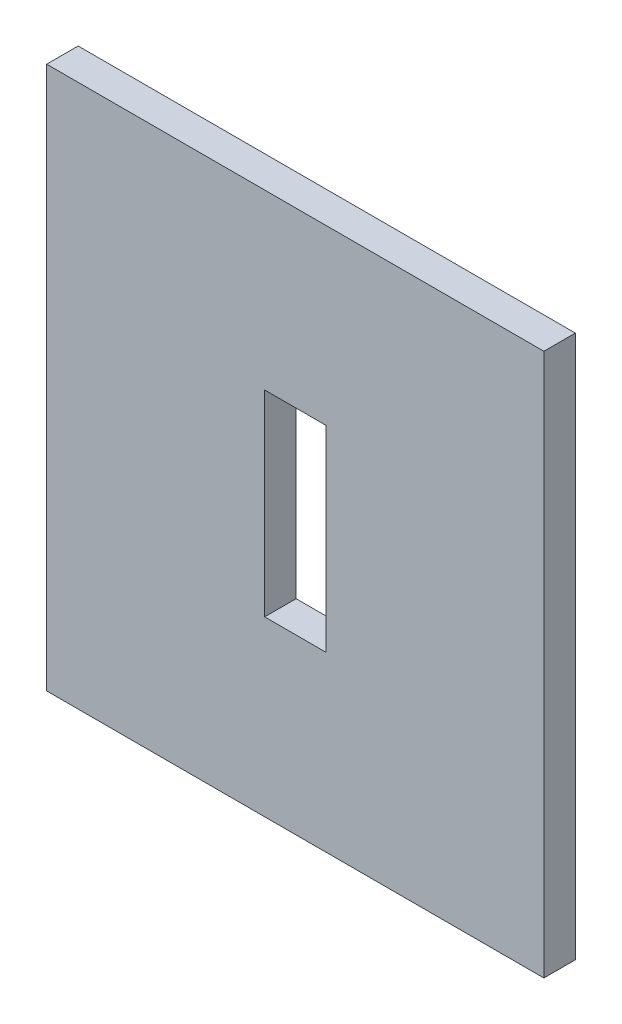
ISO-10303-21;
HEADER;
FILE_DESCRIPTION(('STEP AP214'),'2;1');
FILE_NAME('part.step','',(''),(''),'','','');
FILE_SCHEMA(('AUTOMOTIVE_DESIGN { 1 0 10303 214 1 1 1 1 }'));
ENDSEC;
DATA;
#1=APPLICATION_CONTEXT('core data for automotive mechanical design processes');
#2=APPLICATION_PROTOCOL_DEFINITION('international standard','automotive_design',2000,#1);
#3=PRODUCT_CONTEXT('',#1,'mechanical');
#4=PRODUCT('Part','Part','',(#3));
#5=PRODUCT_RELATED_PRODUCT_CATEGORY('part','',(#4));
#6=PRODUCT_DEFINITION_FORMATION('','',#4);
#7=PRODUCT_DEFINITION_CONTEXT('part definition',#1,'design');
#8=PRODUCT_DEFINITION('design','',#6,#7);
#9=PRODUCT_DEFINITION_SHAPE('','',#8);
#10=(LENGTH_UNIT() NAMED_UNIT(*) SI_UNIT(.MILLI.,.METRE.));
#11=(NAMED_UNIT(*) PLANE_ANGLE_UNIT() SI_UNIT($,.RADIAN.));
#12=(NAMED_UNIT(*) SI_UNIT($,.STERADIAN.) SOLID_ANGLE_UNIT());
#13=UNCERTAINTY_MEASURE_WITH_UNIT(LENGTH_MEASURE(1.E-05),#10,'distance_accuracy_value','');
#14=(GEOMETRIC_REPRESENTATION_CONTEXT(3) GLOBAL_UNCERTAINTY_ASSIGNED_CONTEXT((#13)) GLOBAL_UNIT_ASSIGNED_CONTEXT((#10,
#11,#12)) REPRESENTATION_CONTEXT('',''));
#15=CARTESIAN_POINT('',(0.,0.,0.));
#16=DIRECTION('',(0.,0.,1.));
#17=DIRECTION('',(1.,0.,0.));
#18=AXIS2_PLACEMENT_3D('',#15,#16,#17);
#19=CARTESIAN_POINT('',(25.085,27.385,3.175));
#20=DIRECTION('',(-1.,0.,0.));
#21=DIRECTION('',(0.,-1.,0.));
#22=AXIS2_PLACEMENT_3D('',#19,#20,#21);
#23=PLANE('',#22);
#24=DIRECTION('',(0.,1.,0.));
#25=VECTOR('',#24,1.);
#26=CARTESIAN_POINT('',(25.085,27.385,0.));
#27=LINE('',#26,#25);
#28=CARTESIAN_POINT('',(25.085,-27.385,0.));
#29=VERTEX_POINT('',#28);
#30=CARTESIAN_POINT('',(25.085,27.385,0.));
#31=VERTEX_POINT('',#30);
#32=EDGE_CURVE('E133',#29,#31,#27,.T.);
#33=ORIENTED_EDGE('',*,*,#32,.T.);
#34=DIRECTION('',(0.,0.,-1.));
#35=VECTOR('',#34,1.);
#36=CARTESIAN_POINT('',(25.085,27.385,3.175));
#37=LINE('',#36,#35);
#38=CARTESIAN_POINT('',(25.085,27.385,3.175));
#39=VERTEX_POINT('',#38);
#40=EDGE_CURVE('E11',#39,#31,#37,.T.);
#41=ORIENTED_EDGE('',*,*,#40,.F.);
#42=DIRECTION('',(0.,1.,0.));
#43=VECTOR('',#42,1.);
#44=CARTESIAN_POINT('',(25.085,27.385,3.175));
#45=LINE('',#44,#43);
#46=CARTESIAN_POINT('',(25.085,-27.385,3.175));
#47=VERTEX_POINT('',#46);
#48=EDGE_CURVE('E137',#47,#39,#45,.T.);
#49=ORIENTED_EDGE('',*,*,#48,.F.);
#50=DIRECTION('',(0.,0.,-1.));
#51=VECTOR('',#50,1.);
#52=CARTESIAN_POINT('',(25.085,-27.385,3.175));
#53=LINE('',#52,#51);
#54=EDGE_CURVE('E147',#47,#29,#53,.T.);
#55=ORIENTED_EDGE('',*,*,#54,.T.);
#56=EDGE_LOOP('',(#33,#41,#49,#55));
#57=FACE_BOUND('',#56,.T.);
#58=ADVANCED_FACE('F36',(#57),#23,.F.);
#59=CARTESIAN_POINT('',(-25.085,27.385,3.175));
#60=DIRECTION('',(0.,-1.,0.));
#61=DIRECTION('',(0.,0.,-1.));
#62=AXIS2_PLACEMENT_3D('',#59,#60,#61);
#63=PLANE('',#62);
#64=DIRECTION('',(-1.,0.,0.));
#65=VECTOR('',#64,1.);
#66=CARTESIAN_POINT('',(-25.085,27.385,0.));
#67=LINE('',#66,#65);
#68=CARTESIAN_POINT('',(-25.085,27.385,0.));
#69=VERTEX_POINT('',#68);
#70=EDGE_CURVE('E150',#31,#69,#67,.T.);
#71=ORIENTED_EDGE('',*,*,#70,.T.);
#72=DIRECTION('',(0.,0.,-1.));
#73=VECTOR('',#72,1.);
#74=CARTESIAN_POINT('',(-25.085,27.385,3.175));
#75=LINE('',#74,#73);
#76=CARTESIAN_POINT('',(-25.085,27.385,3.175));
#77=VERTEX_POINT('',#76);
#78=EDGE_CURVE('E43',#77,#69,#75,.T.);
#79=ORIENTED_EDGE('',*,*,#78,.F.);
#80=DIRECTION('',(-1.,0.,0.));
#81=VECTOR('',#80,1.);
#82=CARTESIAN_POINT('',(-25.085,27.385,3.175));
#83=LINE('',#82,#81);
#84=EDGE_CURVE('E140',#39,#77,#83,.T.);
#85=ORIENTED_EDGE('',*,*,#84,.F.);
#86=ORIENTED_EDGE('',*,*,#40,.T.);
#87=EDGE_LOOP('',(#71,#79,#85,#86));
#88=FACE_BOUND('',#87,.T.);
#89=ADVANCED_FACE('F178',(#88),#63,.F.);
#90=CARTESIAN_POINT('',(-25.085,27.385,3.175));
#91=DIRECTION('',(1.,0.,0.));
#92=DIRECTION('',(0.,1.,0.));
#93=AXIS2_PLACEMENT_3D('',#90,#91,#92);
#94=PLANE('',#93);
#95=DIRECTION('',(0.,-1.,0.));
#96=VECTOR('',#95,1.);
#97=CARTESIAN_POINT('',(-25.085,27.385,0.));
#98=LINE('',#97,#96);
#99=CARTESIAN_POINT('',(-25.085,-27.385,0.));
#100=VERTEX_POINT('',#99);
#101=EDGE_CURVE('E152',#69,#100,#98,.T.);
#102=ORIENTED_EDGE('',*,*,#101,.T.);
#103=DIRECTION('',(0.,0.,-1.));
#104=VECTOR('',#103,1.);
#105=CARTESIAN_POINT('',(-25.085,-27.385,3.175));
#106=LINE('',#105,#104);
#107=CARTESIAN_POINT('',(-25.085,-27.385,3.175));
#108=VERTEX_POINT('',#107);
#109=EDGE_CURVE('E157',#108,#100,#106,.T.);
#110=ORIENTED_EDGE('',*,*,#109,.F.);
#111=DIRECTION('',(0.,-1.,0.));
#112=VECTOR('',#111,1.);
#113=CARTESIAN_POINT('',(-25.085,27.385,3.175));
#114=LINE('',#113,#112);
#115=EDGE_CURVE('E143',#77,#108,#114,.T.);
#116=ORIENTED_EDGE('',*,*,#115,.F.);
#117=ORIENTED_EDGE('',*,*,#78,.T.);
#118=EDGE_LOOP('',(#102,#110,#116,#117));
#119=FACE_BOUND('',#118,.T.);
#120=ADVANCED_FACE('F164',(#119),#94,.F.);
#121=CARTESIAN_POINT('',(-25.085,-27.385,3.175));
#122=DIRECTION('',(0.,1.,0.));
#123=DIRECTION('',(0.,0.,1.));
#124=AXIS2_PLACEMENT_3D('',#121,#122,#123);
#125=PLANE('',#124);
#126=DIRECTION('',(1.,0.,0.));
#127=VECTOR('',#126,1.);
#128=CARTESIAN_POINT('',(-25.085,-27.385,0.));
#129=LINE('',#128,#127);
#130=EDGE_CURVE('E141',#100,#29,#129,.T.);
#131=ORIENTED_EDGE('',*,*,#130,.T.);
#132=ORIENTED_EDGE('',*,*,#54,.F.);
#133=DIRECTION('',(1.,0.,0.));
#134=VECTOR('',#133,1.);
#135=CARTESIAN_POINT('',(-25.085,-27.385,3.175));
#136=LINE('',#135,#134);
#137=EDGE_CURVE('E145',#108,#47,#136,.T.);
#138=ORIENTED_EDGE('',*,*,#137,.F.);
#139=ORIENTED_EDGE('',*,*,#109,.T.);
#140=EDGE_LOOP('',(#131,#132,#138,#139));
#141=FACE_BOUND('',#140,.T.);
#142=ADVANCED_FACE('F171',(#141),#125,.F.);
#143=CARTESIAN_POINT('',(0.,0.,3.175));
#144=DIRECTION('',(0.,0.,1.));
#145=DIRECTION('',(1.,0.,0.));
#146=AXIS2_PLACEMENT_3D('',#143,#144,#145);
#147=PLANE('',#146);
#148=DIRECTION('',(0.,-1.,0.));
#149=VECTOR('',#148,1.);
#150=CARTESIAN_POINT('',(-3.09,9.915,3.175));
#151=LINE('',#150,#149);
#152=CARTESIAN_POINT('',(-3.09,9.915,3.175));
#153=VERTEX_POINT('',#152);
#154=CARTESIAN_POINT('',(-3.09,-9.915,3.175));
#155=VERTEX_POINT('',#154);
#156=EDGE_CURVE('E50',#153,#155,#151,.T.);
#157=ORIENTED_EDGE('',*,*,#156,.F.);
#158=DIRECTION('',(-1.,0.,0.));
#159=VECTOR('',#158,1.);
#160=CARTESIAN_POINT('',(3.09,9.915,3.175));
#161=LINE('',#160,#159);
#162=CARTESIAN_POINT('',(3.09,9.915,3.175));
#163=VERTEX_POINT('',#162);
#164=EDGE_CURVE('E118',#163,#153,#161,.T.);
#165=ORIENTED_EDGE('',*,*,#164,.F.);
#166=DIRECTION('',(0.,1.,0.));
#167=VECTOR('',#166,1.);
#168=CARTESIAN_POINT('',(3.09,9.915,3.175));
#169=LINE('',#168,#167);
#170=CARTESIAN_POINT('',(3.09,-9.915,3.175));
#171=VERTEX_POINT('',#170);
#172=EDGE_CURVE('E121',#171,#163,#169,.T.);
#173=ORIENTED_EDGE('',*,*,#172,.F.);
#174=DIRECTION('',(1.,0.,0.));
#175=VECTOR('',#174,1.);
#176=CARTESIAN_POINT('',(3.09,-9.915,3.175));
#177=LINE('',#176,#175);
#178=EDGE_CURVE('E127',#155,#171,#177,.T.);
#179=ORIENTED_EDGE('',*,*,#178,.F.);
#180=EDGE_LOOP('',(#157,#165,#173,#179));
#181=FACE_BOUND('',#180,.T.);
#182=ORIENTED_EDGE('',*,*,#48,.T.);
#183=ORIENTED_EDGE('',*,*,#84,.T.);
#184=ORIENTED_EDGE('',*,*,#115,.T.);
#185=ORIENTED_EDGE('',*,*,#137,.T.);
#186=EDGE_LOOP('',(#182,#183,#184,#185));
#187=FACE_BOUND('',#186,.T.);
#188=ADVANCED_FACE('F177',(#181,#187),#147,.T.);
#189=CARTESIAN_POINT('',(0.,0.,0.));
#190=DIRECTION('',(0.,0.,1.));
#191=DIRECTION('',(1.,0.,0.));
#192=AXIS2_PLACEMENT_3D('',#189,#190,#191);
#193=PLANE('',#192);
#194=DIRECTION('',(-1.,0.,0.));
#195=VECTOR('',#194,1.);
#196=CARTESIAN_POINT('',(3.09,9.915,0.));
#197=LINE('',#196,#195);
#198=CARTESIAN_POINT('',(3.09,9.915,0.));
#199=VERTEX_POINT('',#198);
#200=CARTESIAN_POINT('',(-3.09,9.915,0.));
#201=VERTEX_POINT('',#200);
#202=EDGE_CURVE('E108',#199,#201,#197,.T.);
#203=ORIENTED_EDGE('',*,*,#202,.T.);
#204=DIRECTION('',(0.,-1.,0.));
#205=VECTOR('',#204,1.);
#206=CARTESIAN_POINT('',(-3.09,9.915,0.));
#207=LINE('',#206,#205);
#208=CARTESIAN_POINT('',(-3.09,-9.915,0.));
#209=VERTEX_POINT('',#208);
#210=EDGE_CURVE('E102',#201,#209,#207,.T.);
#211=ORIENTED_EDGE('',*,*,#210,.T.);
#212=DIRECTION('',(1.,0.,0.));
#213=VECTOR('',#212,1.);
#214=CARTESIAN_POINT('',(3.09,-9.915,0.));
#215=LINE('',#214,#213);
#216=CARTESIAN_POINT('',(3.09,-9.915,0.));
#217=VERTEX_POINT('',#216);
#218=EDGE_CURVE('E111',#209,#217,#215,.T.);
#219=ORIENTED_EDGE('',*,*,#218,.T.);
#220=DIRECTION('',(0.,1.,0.));
#221=VECTOR('',#220,1.);
#222=CARTESIAN_POINT('',(3.09,9.915,0.));
#223=LINE('',#222,#221);
#224=EDGE_CURVE('E58',#217,#199,#223,.T.);
#225=ORIENTED_EDGE('',*,*,#224,.T.);
#226=EDGE_LOOP('',(#203,#211,#219,#225));
#227=FACE_BOUND('',#226,.T.);
#228=ORIENTED_EDGE('',*,*,#32,.F.);
#229=ORIENTED_EDGE('',*,*,#130,.F.);
#230=ORIENTED_EDGE('',*,*,#101,.F.);
#231=ORIENTED_EDGE('',*,*,#70,.F.);
#232=EDGE_LOOP('',(#228,#229,#230,#231));
#233=FACE_BOUND('',#232,.T.);
#234=ADVANCED_FACE('F115',(#227,#233),#193,.F.);
#235=CARTESIAN_POINT('',(-3.09,9.915,0.));
#236=DIRECTION('',(-1.,0.,0.));
#237=DIRECTION('',(0.,-1.,0.));
#238=AXIS2_PLACEMENT_3D('',#235,#236,#237);
#239=PLANE('',#238);
#240=ORIENTED_EDGE('',*,*,#156,.T.);
#241=DIRECTION('',(0.,0.,1.));
#242=VECTOR('',#241,1.);
#243=CARTESIAN_POINT('',(-3.09,-9.915,0.));
#244=LINE('',#243,#242);
#245=EDGE_CURVE('E98',#209,#155,#244,.T.);
#246=ORIENTED_EDGE('',*,*,#245,.F.);
#247=ORIENTED_EDGE('',*,*,#210,.F.);
#248=DIRECTION('',(0.,0.,1.));
#249=VECTOR('',#248,1.);
#250=CARTESIAN_POINT('',(-3.09,9.915,0.));
#251=LINE('',#250,#249);
#252=EDGE_CURVE('E131',#201,#153,#251,.T.);
#253=ORIENTED_EDGE('',*,*,#252,.T.);
#254=EDGE_LOOP('',(#240,#246,#247,#253));
#255=FACE_BOUND('',#254,.T.);
#256=ADVANCED_FACE('F100',(#255),#239,.F.);
#257=CARTESIAN_POINT('',(3.09,9.915,0.));
#258=DIRECTION('',(0.,1.,0.));
#259=DIRECTION('',(0.,0.,1.));
#260=AXIS2_PLACEMENT_3D('',#257,#258,#259);
#261=PLANE('',#260);
#262=ORIENTED_EDGE('',*,*,#164,.T.);
#263=ORIENTED_EDGE('',*,*,#252,.F.);
#264=ORIENTED_EDGE('',*,*,#202,.F.);
#265=DIRECTION('',(0.,0.,1.));
#266=VECTOR('',#265,1.);
#267=CARTESIAN_POINT('',(3.09,9.915,0.));
#268=LINE('',#267,#266);
#269=EDGE_CURVE('E134',#199,#163,#268,.T.);
#270=ORIENTED_EDGE('',*,*,#269,.T.);
#271=EDGE_LOOP('',(#262,#263,#264,#270));
#272=FACE_BOUND('',#271,.T.);
#273=ADVANCED_FACE('F195',(#272),#261,.F.);
#274=CARTESIAN_POINT('',(3.09,9.915,0.));
#275=DIRECTION('',(1.,0.,0.));
#276=DIRECTION('',(0.,1.,0.));
#277=AXIS2_PLACEMENT_3D('',#274,#275,#276);
#278=PLANE('',#277);
#279=ORIENTED_EDGE('',*,*,#172,.T.);
#280=ORIENTED_EDGE('',*,*,#269,.F.);
#281=ORIENTED_EDGE('',*,*,#224,.F.);
#282=DIRECTION('',(0.,0.,1.));
#283=VECTOR('',#282,1.);
#284=CARTESIAN_POINT('',(3.09,-9.915,0.));
#285=LINE('',#284,#283);
#286=EDGE_CURVE('E107',#217,#171,#285,.T.);
#287=ORIENTED_EDGE('',*,*,#286,.T.);
#288=EDGE_LOOP('',(#279,#280,#281,#287));
#289=FACE_BOUND('',#288,.T.);
#290=ADVANCED_FACE('F198',(#289),#278,.F.);
#291=CARTESIAN_POINT('',(3.09,-9.915,0.));
#292=DIRECTION('',(0.,-1.,0.));
#293=DIRECTION('',(0.,0.,-1.));
#294=AXIS2_PLACEMENT_3D('',#291,#292,#293);
#295=PLANE('',#294);
#296=ORIENTED_EDGE('',*,*,#178,.T.);
#297=ORIENTED_EDGE('',*,*,#286,.F.);
#298=ORIENTED_EDGE('',*,*,#218,.F.);
#299=ORIENTED_EDGE('',*,*,#245,.T.);
#300=EDGE_LOOP('',(#296,#297,#298,#299));
#301=FACE_BOUND('',#300,.T.);
#302=ADVANCED_FACE('F112',(#301),#295,.F.);
#303=CLOSED_SHELL('',(#58,#89,#120,#142,#188,#234,#256,#273,#290,#302));
#304=MANIFOLD_SOLID_BREP('B2',#303);
#305=ADVANCED_BREP_SHAPE_REPRESENTATION('',(#18,#304),#14);
#306=SHAPE_DEFINITION_REPRESENTATION(#9,#305);
ENDSEC;
END-ISO-10303-21;
